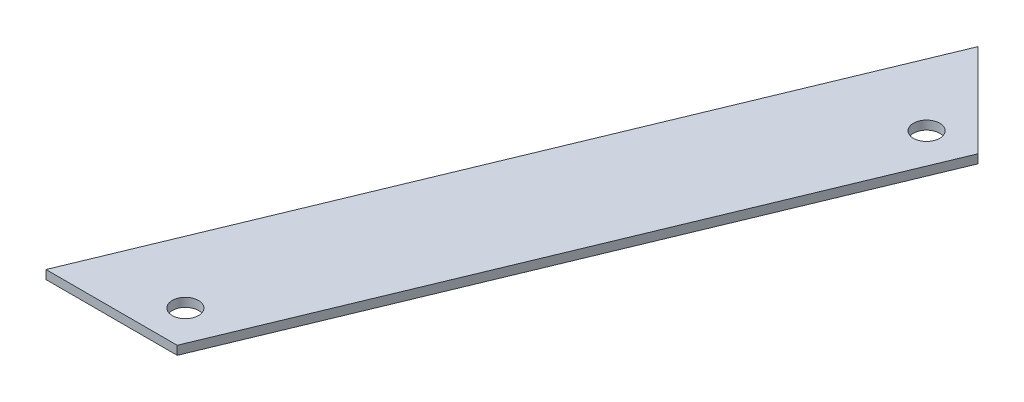
ISO-10303-21;
HEADER;
FILE_DESCRIPTION(('STEP AP214'),'2;1');
FILE_NAME('part.step','',(''),(''),'','','');
FILE_SCHEMA(('AUTOMOTIVE_DESIGN { 1 0 10303 214 1 1 1 1 }'));
ENDSEC;
DATA;
#1=APPLICATION_CONTEXT('core data for automotive mechanical design processes');
#2=APPLICATION_PROTOCOL_DEFINITION('international standard','automotive_design',2000,#1);
#3=PRODUCT_CONTEXT('',#1,'mechanical');
#4=PRODUCT('Part','Part','',(#3));
#5=PRODUCT_RELATED_PRODUCT_CATEGORY('part','',(#4));
#6=PRODUCT_DEFINITION_FORMATION('','',#4);
#7=PRODUCT_DEFINITION_CONTEXT('part definition',#1,'design');
#8=PRODUCT_DEFINITION('design','',#6,#7);
#9=PRODUCT_DEFINITION_SHAPE('','',#8);
#10=(LENGTH_UNIT() NAMED_UNIT(*) SI_UNIT(.MILLI.,.METRE.));
#11=(NAMED_UNIT(*) PLANE_ANGLE_UNIT() SI_UNIT($,.RADIAN.));
#12=(NAMED_UNIT(*) SI_UNIT($,.STERADIAN.) SOLID_ANGLE_UNIT());
#13=UNCERTAINTY_MEASURE_WITH_UNIT(LENGTH_MEASURE(1.E-05),#10,'distance_accuracy_value','');
#14=(GEOMETRIC_REPRESENTATION_CONTEXT(3) GLOBAL_UNCERTAINTY_ASSIGNED_CONTEXT((#13)) GLOBAL_UNIT_ASSIGNED_CONTEXT((#10,
#11,#12)) REPRESENTATION_CONTEXT('',''));
#15=CARTESIAN_POINT('',(0.,0.,0.));
#16=DIRECTION('',(0.,0.,1.));
#17=DIRECTION('',(1.,0.,0.));
#18=AXIS2_PLACEMENT_3D('',#15,#16,#17);
#19=CARTESIAN_POINT('',(11571.1444134132,10.,26619.2119313587));
#20=DIRECTION('',(0.,1.,0.));
#21=DIRECTION('',(0.,0.,1.));
#22=AXIS2_PLACEMENT_3D('',#19,#20,#21);
#23=PLANE('',#22);
#24=DIRECTION('',(1.,0.,0.));
#25=VECTOR('',#24,1.);
#26=CARTESIAN_POINT('',(11528.6922390228,10.,26687.8257165079));
#27=LINE('',#26,#25);
#28=CARTESIAN_POINT('',(11528.6922390228,10.,26687.8257165079));
#29=VERTEX_POINT('',#28);
#30=CARTESIAN_POINT('',(11558.6922390228,10.,26687.8257165079));
#31=VERTEX_POINT('',#30);
#32=EDGE_CURVE('E56',#29,#31,#27,.T.);
#33=ORIENTED_EDGE('',*,*,#32,.F.);
#34=DIRECTION('',(-0.382683432365094,0.,0.923879532511285));
#35=VECTOR('',#34,1.);
#36=CARTESIAN_POINT('',(11589.6434657876,10.,26540.6764382092));
#37=LINE('',#36,#35);
#38=CARTESIAN_POINT('',(11591.1079318816,10.,26537.1409043033));
#39=VERTEX_POINT('',#38);
#40=EDGE_CURVE('E61',#39,#29,#37,.T.);
#41=ORIENTED_EDGE('',*,*,#40,.F.);
#42=DIRECTION('',(-0.707106781186547,0.,-0.707106781186548));
#43=VECTOR('',#42,1.);
#44=CARTESIAN_POINT('',(11612.3211353172,10.,26558.3541077389));
#45=LINE('',#44,#43);
#46=CARTESIAN_POINT('',(11612.3211353172,10.,26558.3541077389));
#47=VERTEX_POINT('',#46);
#48=EDGE_CURVE('E181',#47,#39,#45,.T.);
#49=ORIENTED_EDGE('',*,*,#48,.F.);
#50=DIRECTION('',(0.382683432365062,0.,-0.923879532511298));
#51=VECTOR('',#50,1.);
#52=CARTESIAN_POINT('',(11558.6922390228,10.,26687.8257165079));
#53=LINE('',#52,#51);
#54=EDGE_CURVE('E63',#31,#47,#53,.T.);
#55=ORIENTED_EDGE('',*,*,#54,.F.);
#56=EDGE_LOOP('',(#33,#41,#49,#55));
#57=FACE_BOUND('',#56,.T.);
#58=CARTESIAN_POINT('',(11601.8847828443,10.,26559.6768219499));
#59=DIRECTION('',(0.,-1.,0.));
#60=DIRECTION('',(0.,0.,-1.));
#61=AXIS2_PLACEMENT_3D('',#58,#59,#60);
#62=CIRCLE('',#61,3.);
#63=CARTESIAN_POINT('',(11601.8847828443,10.,26556.6768219499));
#64=VERTEX_POINT('',#63);
#65=EDGE_CURVE('E73',#64,#64,#62,.F.);
#66=ORIENTED_EDGE('',*,*,#65,.T.);
#67=EDGE_LOOP('',(#66));
#68=FACE_BOUND('',#67,.T.);
#69=CARTESIAN_POINT('',(11552.2479236065,10.,26679.5108007153));
#70=DIRECTION('',(0.,-1.,0.));
#71=DIRECTION('',(0.,0.,-1.));
#72=AXIS2_PLACEMENT_3D('',#69,#70,#71);
#73=CIRCLE('',#72,3.);
#74=CARTESIAN_POINT('',(11552.2479236065,10.,26676.5108007153));
#75=VERTEX_POINT('',#74);
#76=EDGE_CURVE('E20',#75,#75,#73,.F.);
#77=ORIENTED_EDGE('',*,*,#76,.T.);
#78=EDGE_LOOP('',(#77));
#79=FACE_BOUND('',#78,.T.);
#80=ADVANCED_FACE('F17',(#57,#68,#79),#23,.F.);
#81=CARTESIAN_POINT('',(11552.2479236065,12.,26679.5108007153));
#82=DIRECTION('',(0.,-1.,0.));
#83=DIRECTION('',(0.,0.,-1.));
#84=AXIS2_PLACEMENT_3D('',#81,#82,#83);
#85=CYLINDRICAL_SURFACE('',#84,3.);
#86=ORIENTED_EDGE('',*,*,#76,.F.);
#87=EDGE_LOOP('',(#86));
#88=FACE_BOUND('',#87,.T.);
#89=CARTESIAN_POINT('',(11552.2479236065,12.,26679.5108007153));
#90=DIRECTION('',(0.,-1.,0.));
#91=DIRECTION('',(0.,0.,-1.));
#92=AXIS2_PLACEMENT_3D('',#89,#90,#91);
#93=CIRCLE('',#92,3.);
#94=CARTESIAN_POINT('',(11552.2479236065,12.,26676.5108007153));
#95=VERTEX_POINT('',#94);
#96=EDGE_CURVE('E88',#95,#95,#93,.T.);
#97=ORIENTED_EDGE('',*,*,#96,.F.);
#98=EDGE_LOOP('',(#97));
#99=FACE_BOUND('',#98,.T.);
#100=ADVANCED_FACE('F96',(#88,#99),#85,.F.);
#101=CARTESIAN_POINT('',(11601.8847828443,12.,26559.6768219499));
#102=DIRECTION('',(0.,-1.,0.));
#103=DIRECTION('',(0.,0.,-1.));
#104=AXIS2_PLACEMENT_3D('',#101,#102,#103);
#105=CYLINDRICAL_SURFACE('',#104,3.);
#106=ORIENTED_EDGE('',*,*,#65,.F.);
#107=EDGE_LOOP('',(#106));
#108=FACE_BOUND('',#107,.T.);
#109=CARTESIAN_POINT('',(11601.8847828443,12.,26559.6768219499));
#110=DIRECTION('',(0.,-1.,0.));
#111=DIRECTION('',(0.,0.,-1.));
#112=AXIS2_PLACEMENT_3D('',#109,#110,#111);
#113=CIRCLE('',#112,3.);
#114=CARTESIAN_POINT('',(11601.8847828443,12.,26556.6768219499));
#115=VERTEX_POINT('',#114);
#116=EDGE_CURVE('E84',#115,#115,#113,.T.);
#117=ORIENTED_EDGE('',*,*,#116,.F.);
#118=EDGE_LOOP('',(#117));
#119=FACE_BOUND('',#118,.T.);
#120=ADVANCED_FACE('F99',(#108,#119),#105,.F.);
#121=CARTESIAN_POINT('',(11589.6434657876,10.,26540.6764382092));
#122=DIRECTION('',(-0.923879532511285,0.,-0.382683432365094));
#123=DIRECTION('',(-0.382683432365094,0.,0.923879532511285));
#124=AXIS2_PLACEMENT_3D('',#121,#122,#123);
#125=PLANE('',#124);
#126=DIRECTION('',(-0.382683432365049,0.,0.923879532511304));
#127=VECTOR('',#126,1.);
#128=CARTESIAN_POINT('',(11591.1079318816,12.,26537.1409043033));
#129=LINE('',#128,#127);
#130=CARTESIAN_POINT('',(11591.1079318816,12.,26537.1409043033));
#131=VERTEX_POINT('',#130);
#132=CARTESIAN_POINT('',(11528.6922390228,12.,26687.8257165079));
#133=VERTEX_POINT('',#132);
#134=EDGE_CURVE('E87',#131,#133,#129,.T.);
#135=ORIENTED_EDGE('',*,*,#134,.F.);
#136=DIRECTION('',(0.,1.,0.));
#137=VECTOR('',#136,1.);
#138=CARTESIAN_POINT('',(11591.1079318816,10.,26537.1409043033));
#139=LINE('',#138,#137);
#140=EDGE_CURVE('E71',#39,#131,#139,.T.);
#141=ORIENTED_EDGE('',*,*,#140,.F.);
#142=ORIENTED_EDGE('',*,*,#40,.T.);
#143=DIRECTION('',(0.,-1.,0.));
#144=VECTOR('',#143,1.);
#145=CARTESIAN_POINT('',(11528.6922390228,10.,26687.8257165079));
#146=LINE('',#145,#144);
#147=EDGE_CURVE('E65',#133,#29,#146,.T.);
#148=ORIENTED_EDGE('',*,*,#147,.F.);
#149=EDGE_LOOP('',(#135,#141,#142,#148));
#150=FACE_BOUND('',#149,.T.);
#151=ADVANCED_FACE('F68',(#150),#125,.T.);
#152=CARTESIAN_POINT('',(11528.6922390228,10.,26687.8257165079));
#153=DIRECTION('',(0.,0.,1.));
#154=DIRECTION('',(0.,-1.,0.));
#155=AXIS2_PLACEMENT_3D('',#152,#153,#154);
#156=PLANE('',#155);
#157=DIRECTION('',(1.,0.,0.));
#158=VECTOR('',#157,1.);
#159=CARTESIAN_POINT('',(11571.1444134132,12.,26687.8257165079));
#160=LINE('',#159,#158);
#161=CARTESIAN_POINT('',(11558.6922390228,12.,26687.8257165079));
#162=VERTEX_POINT('',#161);
#163=EDGE_CURVE('E77',#133,#162,#160,.T.);
#164=ORIENTED_EDGE('',*,*,#163,.F.);
#165=ORIENTED_EDGE('',*,*,#147,.T.);
#166=ORIENTED_EDGE('',*,*,#32,.T.);
#167=DIRECTION('',(0.,1.,0.));
#168=VECTOR('',#167,1.);
#169=CARTESIAN_POINT('',(11558.6922390228,10.,26687.8257165079));
#170=LINE('',#169,#168);
#171=EDGE_CURVE('E79',#162,#31,#170,.F.);
#172=ORIENTED_EDGE('',*,*,#171,.F.);
#173=EDGE_LOOP('',(#164,#165,#166,#172));
#174=FACE_BOUND('',#173,.T.);
#175=ADVANCED_FACE('F75',(#174),#156,.T.);
#176=CARTESIAN_POINT('',(11558.6922390228,10.,26687.8257165079));
#177=DIRECTION('',(0.923879532511298,0.,0.382683432365062));
#178=DIRECTION('',(0.382683432365062,0.,-0.923879532511298));
#179=AXIS2_PLACEMENT_3D('',#176,#177,#178);
#180=PLANE('',#179);
#181=ORIENTED_EDGE('',*,*,#54,.T.);
#182=DIRECTION('',(0.,1.,0.));
#183=VECTOR('',#182,1.);
#184=CARTESIAN_POINT('',(11612.3211353172,10.,26558.3541077389));
#185=LINE('',#184,#183);
#186=CARTESIAN_POINT('',(11612.3211353172,12.,26558.3541077389));
#187=VERTEX_POINT('',#186);
#188=EDGE_CURVE('E35',#187,#47,#185,.F.);
#189=ORIENTED_EDGE('',*,*,#188,.F.);
#190=DIRECTION('',(0.382683432365014,0.,-0.923879532511318));
#191=VECTOR('',#190,1.);
#192=CARTESIAN_POINT('',(11558.6922390228,12.,26687.8257165079));
#193=LINE('',#192,#191);
#194=EDGE_CURVE('E26',#162,#187,#193,.T.);
#195=ORIENTED_EDGE('',*,*,#194,.F.);
#196=ORIENTED_EDGE('',*,*,#171,.T.);
#197=EDGE_LOOP('',(#181,#189,#195,#196));
#198=FACE_BOUND('',#197,.T.);
#199=ADVANCED_FACE('F111',(#198),#180,.T.);
#200=CARTESIAN_POINT('',(11612.3211353172,10.,26558.3541077389));
#201=DIRECTION('',(0.707106781186548,0.,-0.707106781186547));
#202=DIRECTION('',(-0.707106781186547,0.,-0.707106781186548));
#203=AXIS2_PLACEMENT_3D('',#200,#201,#202);
#204=PLANE('',#203);
#205=DIRECTION('',(-0.707106781186459,0.,-0.707106781186636));
#206=VECTOR('',#205,1.);
#207=CARTESIAN_POINT('',(11612.3211353172,12.,26558.3541077389));
#208=LINE('',#207,#206);
#209=EDGE_CURVE('E11',#187,#131,#208,.T.);
#210=ORIENTED_EDGE('',*,*,#209,.F.);
#211=ORIENTED_EDGE('',*,*,#188,.T.);
#212=ORIENTED_EDGE('',*,*,#48,.T.);
#213=ORIENTED_EDGE('',*,*,#140,.T.);
#214=EDGE_LOOP('',(#210,#211,#212,#213));
#215=FACE_BOUND('',#214,.T.);
#216=ADVANCED_FACE('F104',(#215),#204,.T.);
#217=CARTESIAN_POINT('',(11571.1444134132,12.,26619.2119313587));
#218=DIRECTION('',(0.,1.,0.));
#219=DIRECTION('',(0.,0.,1.));
#220=AXIS2_PLACEMENT_3D('',#217,#218,#219);
#221=PLANE('',#220);
#222=ORIENTED_EDGE('',*,*,#194,.T.);
#223=ORIENTED_EDGE('',*,*,#209,.T.);
#224=ORIENTED_EDGE('',*,*,#134,.T.);
#225=ORIENTED_EDGE('',*,*,#163,.T.);
#226=EDGE_LOOP('',(#222,#223,#224,#225));
#227=FACE_BOUND('',#226,.T.);
#228=ORIENTED_EDGE('',*,*,#116,.T.);
#229=EDGE_LOOP('',(#228));
#230=FACE_BOUND('',#229,.T.);
#231=ORIENTED_EDGE('',*,*,#96,.T.);
#232=EDGE_LOOP('',(#231));
#233=FACE_BOUND('',#232,.T.);
#234=ADVANCED_FACE('F102',(#227,#230,#233),#221,.T.);
#235=CLOSED_SHELL('',(#80,#100,#120,#151,#175,#199,#216,#234));
#236=MANIFOLD_SOLID_BREP('B1',#235);
#237=ADVANCED_BREP_SHAPE_REPRESENTATION('',(#18,#236),#14);
#238=SHAPE_DEFINITION_REPRESENTATION(#9,#237);
ENDSEC;
END-ISO-10303-21;
